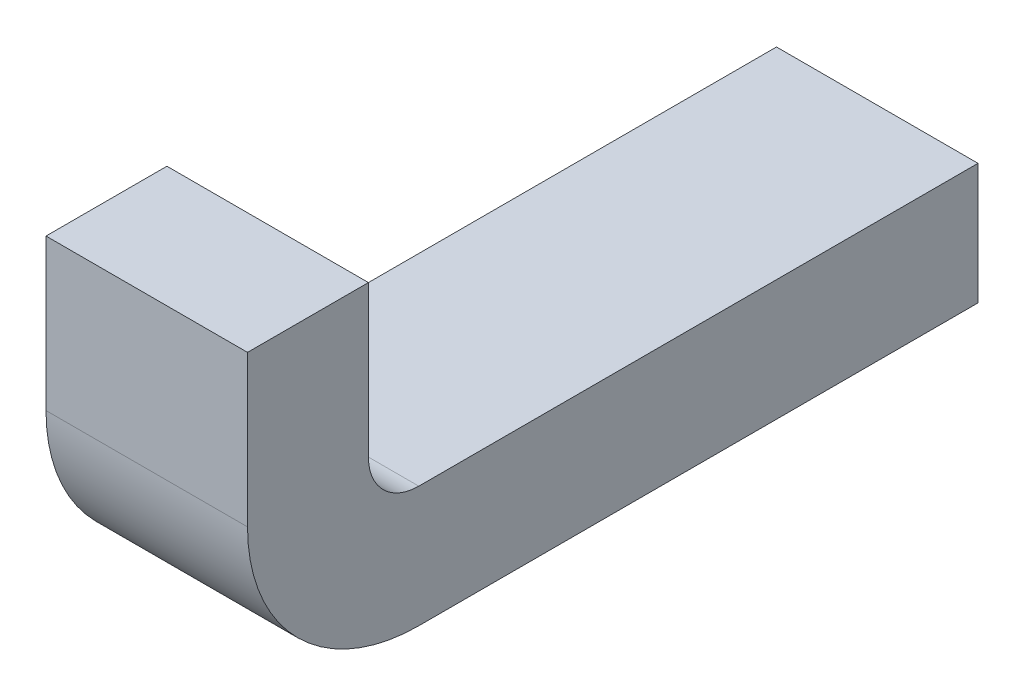
ISO-10303-21;
HEADER;
FILE_DESCRIPTION(('STEP AP214'),'2;1');
FILE_NAME('part.step','',(''),(''),'','','');
FILE_SCHEMA(('AUTOMOTIVE_DESIGN { 1 0 10303 214 1 1 1 1 }'));
ENDSEC;
DATA;
#1=APPLICATION_CONTEXT('core data for automotive mechanical design processes');
#2=APPLICATION_PROTOCOL_DEFINITION('international standard','automotive_design',2000,#1);
#3=PRODUCT_CONTEXT('',#1,'mechanical');
#4=PRODUCT('Part','Part','',(#3));
#5=PRODUCT_RELATED_PRODUCT_CATEGORY('part','',(#4));
#6=PRODUCT_DEFINITION_FORMATION('','',#4);
#7=PRODUCT_DEFINITION_CONTEXT('part definition',#1,'design');
#8=PRODUCT_DEFINITION('design','',#6,#7);
#9=PRODUCT_DEFINITION_SHAPE('','',#8);
#10=(LENGTH_UNIT() NAMED_UNIT(*) SI_UNIT(.MILLI.,.METRE.));
#11=(NAMED_UNIT(*) PLANE_ANGLE_UNIT() SI_UNIT($,.RADIAN.));
#12=(NAMED_UNIT(*) SI_UNIT($,.STERADIAN.) SOLID_ANGLE_UNIT());
#13=UNCERTAINTY_MEASURE_WITH_UNIT(LENGTH_MEASURE(1.E-05),#10,'distance_accuracy_value','');
#14=(GEOMETRIC_REPRESENTATION_CONTEXT(3) GLOBAL_UNCERTAINTY_ASSIGNED_CONTEXT((#13)) GLOBAL_UNIT_ASSIGNED_CONTEXT((#10,
#11,#12)) REPRESENTATION_CONTEXT('',''));
#15=CARTESIAN_POINT('',(0.,0.,0.));
#16=DIRECTION('',(0.,0.,1.));
#17=DIRECTION('',(1.,0.,0.));
#18=AXIS2_PLACEMENT_3D('',#15,#16,#17);
#19=CARTESIAN_POINT('',(1.65,0.,-3.300000000002));
#20=DIRECTION('',(0.,-1.,0.));
#21=DIRECTION('',(1.,0.,0.));
#22=AXIS2_PLACEMENT_3D('',#19,#20,#21);
#23=PLANE('',#22);
#24=DIRECTION('',(0.,0.,1.));
#25=VECTOR('',#24,1.);
#26=CARTESIAN_POINT('',(1.65,0.,-3.300000000002));
#27=LINE('',#26,#25);
#28=CARTESIAN_POINT('',(1.65,0.,-3.300000000002));
#29=VERTEX_POINT('',#28);
#30=CARTESIAN_POINT('',(1.65,0.,-3.854999999999));
#31=VERTEX_POINT('',#30);
#32=EDGE_CURVE('E121',#29,#31,#27,.F.);
#33=ORIENTED_EDGE('',*,*,#32,.T.);
#34=DIRECTION('',(-1.,0.,0.));
#35=VECTOR('',#34,1.);
#36=CARTESIAN_POINT('',(1.65,0.,-3.854999999999));
#37=LINE('',#36,#35);
#38=CARTESIAN_POINT('',(1.85,0.,-3.854999999999));
#39=VERTEX_POINT('',#38);
#40=EDGE_CURVE('E124',#39,#31,#37,.T.);
#41=ORIENTED_EDGE('',*,*,#40,.F.);
#42=DIRECTION('',(0.,0.,1.));
#43=VECTOR('',#42,1.);
#44=CARTESIAN_POINT('',(1.85,0.,-3.300000000002));
#45=LINE('',#44,#43);
#46=CARTESIAN_POINT('',(1.85,0.,-3.300000000002));
#47=VERTEX_POINT('',#46);
#48=EDGE_CURVE('E154',#47,#39,#45,.F.);
#49=ORIENTED_EDGE('',*,*,#48,.F.);
#50=DIRECTION('',(1.,0.,0.));
#51=VECTOR('',#50,1.);
#52=CARTESIAN_POINT('',(1.65,0.,-3.300000000002));
#53=LINE('',#52,#51);
#54=EDGE_CURVE('E63',#29,#47,#53,.T.);
#55=ORIENTED_EDGE('',*,*,#54,.F.);
#56=EDGE_LOOP('',(#33,#41,#49,#55));
#57=FACE_BOUND('',#56,.T.);
#58=ADVANCED_FACE('F16',(#57),#23,.T.);
#59=CARTESIAN_POINT('',(1.65,0.32,-3.250000000002));
#60=DIRECTION('',(0.,1.,1.246832498358E-13));
#61=DIRECTION('',(0.,-1.246832498358E-13,1.));
#62=AXIS2_PLACEMENT_3D('',#59,#60,#61);
#63=PLANE('',#62);
#64=DIRECTION('',(0.,0.,1.));
#65=VECTOR('',#64,1.);
#66=CARTESIAN_POINT('',(1.65,0.32,-3.300000000002));
#67=LINE('',#66,#65);
#68=CARTESIAN_POINT('',(1.65,0.32,-3.250000000002));
#69=VERTEX_POINT('',#68);
#70=CARTESIAN_POINT('',(1.65,0.32,-3.130000000002));
#71=VERTEX_POINT('',#70);
#72=EDGE_CURVE('E100',#69,#71,#67,.T.);
#73=ORIENTED_EDGE('',*,*,#72,.T.);
#74=DIRECTION('',(1.,0.,0.));
#75=VECTOR('',#74,1.);
#76=CARTESIAN_POINT('',(1.65,0.32,-3.130000000002));
#77=LINE('',#76,#75);
#78=CARTESIAN_POINT('',(1.85,0.32,-3.130000000002));
#79=VERTEX_POINT('',#78);
#80=EDGE_CURVE('E162',#79,#71,#77,.F.);
#81=ORIENTED_EDGE('',*,*,#80,.F.);
#82=DIRECTION('',(0.,0.,1.));
#83=VECTOR('',#82,1.);
#84=CARTESIAN_POINT('',(1.85,0.32,-3.300000000002));
#85=LINE('',#84,#83);
#86=CARTESIAN_POINT('',(1.85,0.32,-3.250000000002));
#87=VERTEX_POINT('',#86);
#88=EDGE_CURVE('E150',#87,#79,#85,.T.);
#89=ORIENTED_EDGE('',*,*,#88,.F.);
#90=DIRECTION('',(-1.,0.,0.));
#91=VECTOR('',#90,1.);
#92=CARTESIAN_POINT('',(1.65,0.32,-3.250000000002));
#93=LINE('',#92,#91);
#94=EDGE_CURVE('E72',#69,#87,#93,.F.);
#95=ORIENTED_EDGE('',*,*,#94,.F.);
#96=EDGE_LOOP('',(#73,#81,#89,#95));
#97=FACE_BOUND('',#96,.T.);
#98=ADVANCED_FACE('F182',(#97),#63,.T.);
#99=CARTESIAN_POINT('',(1.65,0.32,-3.130000000002));
#100=DIRECTION('',(0.,0.,1.));
#101=DIRECTION('',(1.,0.,0.));
#102=AXIS2_PLACEMENT_3D('',#99,#100,#101);
#103=PLANE('',#102);
#104=DIRECTION('',(0.,1.,0.));
#105=VECTOR('',#104,1.);
#106=CARTESIAN_POINT('',(1.65,0.17,-3.130000000002));
#107=LINE('',#106,#105);
#108=CARTESIAN_POINT('',(1.65,0.17,-3.130000000002));
#109=VERTEX_POINT('',#108);
#110=EDGE_CURVE('E110',#71,#109,#107,.F.);
#111=ORIENTED_EDGE('',*,*,#110,.T.);
#112=DIRECTION('',(1.,0.,0.));
#113=VECTOR('',#112,1.);
#114=CARTESIAN_POINT('',(1.65,0.17,-3.130000000002));
#115=LINE('',#114,#113);
#116=CARTESIAN_POINT('',(1.85,0.17,-3.130000000002));
#117=VERTEX_POINT('',#116);
#118=EDGE_CURVE('E57',#117,#109,#115,.F.);
#119=ORIENTED_EDGE('',*,*,#118,.F.);
#120=DIRECTION('',(0.,1.,0.));
#121=VECTOR('',#120,1.);
#122=CARTESIAN_POINT('',(1.85,0.17,-3.130000000002));
#123=LINE('',#122,#121);
#124=EDGE_CURVE('E141',#79,#117,#123,.F.);
#125=ORIENTED_EDGE('',*,*,#124,.F.);
#126=ORIENTED_EDGE('',*,*,#80,.T.);
#127=EDGE_LOOP('',(#111,#119,#125,#126));
#128=FACE_BOUND('',#127,.T.);
#129=ADVANCED_FACE('F183',(#128),#103,.T.);
#130=CARTESIAN_POINT('',(1.65,0.17,-3.300000000002));
#131=DIRECTION('',(1.,0.,0.));
#132=DIRECTION('',(0.,1.,0.));
#133=AXIS2_PLACEMENT_3D('',#130,#131,#132);
#134=CYLINDRICAL_SURFACE('',#133,0.17);
#135=CARTESIAN_POINT('',(1.65,0.17,-3.300000000002));
#136=DIRECTION('',(1.,0.,0.));
#137=DIRECTION('',(0.,1.,0.));
#138=AXIS2_PLACEMENT_3D('',#135,#136,#137);
#139=CIRCLE('',#138,0.17);
#140=EDGE_CURVE('E96',#109,#29,#139,.T.);
#141=ORIENTED_EDGE('',*,*,#140,.T.);
#142=ORIENTED_EDGE('',*,*,#54,.T.);
#143=CARTESIAN_POINT('',(1.85,0.17,-3.300000000002));
#144=DIRECTION('',(1.,0.,0.));
#145=DIRECTION('',(0.,1.,0.));
#146=AXIS2_PLACEMENT_3D('',#143,#144,#145);
#147=CIRCLE('',#146,0.17);
#148=EDGE_CURVE('E19',#117,#47,#147,.T.);
#149=ORIENTED_EDGE('',*,*,#148,.F.);
#150=ORIENTED_EDGE('',*,*,#118,.T.);
#151=EDGE_LOOP('',(#141,#142,#149,#150));
#152=FACE_BOUND('',#151,.T.);
#153=ADVANCED_FACE('F185',(#152),#134,.T.);
#154=CARTESIAN_POINT('',(1.65,0.17,-3.250000000002));
#155=DIRECTION('',(0.,0.,-1.));
#156=DIRECTION('',(-1.,0.,0.));
#157=AXIS2_PLACEMENT_3D('',#154,#155,#156);
#158=PLANE('',#157);
#159=DIRECTION('',(0.,1.,0.));
#160=VECTOR('',#159,1.);
#161=CARTESIAN_POINT('',(1.65,0.17,-3.250000000002));
#162=LINE('',#161,#160);
#163=CARTESIAN_POINT('',(1.65,0.17,-3.250000000002));
#164=VERTEX_POINT('',#163);
#165=EDGE_CURVE('E92',#164,#69,#162,.T.);
#166=ORIENTED_EDGE('',*,*,#165,.T.);
#167=ORIENTED_EDGE('',*,*,#94,.T.);
#168=DIRECTION('',(0.,1.,0.));
#169=VECTOR('',#168,1.);
#170=CARTESIAN_POINT('',(1.85,0.17,-3.250000000002));
#171=LINE('',#170,#169);
#172=CARTESIAN_POINT('',(1.85,0.17,-3.250000000002));
#173=VERTEX_POINT('',#172);
#174=EDGE_CURVE('E87',#173,#87,#171,.T.);
#175=ORIENTED_EDGE('',*,*,#174,.F.);
#176=DIRECTION('',(1.,0.,0.));
#177=VECTOR('',#176,1.);
#178=CARTESIAN_POINT('',(1.65,0.17,-3.250000000002));
#179=LINE('',#178,#177);
#180=EDGE_CURVE('E90',#173,#164,#179,.F.);
#181=ORIENTED_EDGE('',*,*,#180,.T.);
#182=EDGE_LOOP('',(#166,#167,#175,#181));
#183=FACE_BOUND('',#182,.T.);
#184=ADVANCED_FACE('F91',(#183),#158,.T.);
#185=CARTESIAN_POINT('',(1.85,0.17,-3.300000000002));
#186=DIRECTION('',(1.,0.,0.));
#187=DIRECTION('',(0.,1.,0.));
#188=AXIS2_PLACEMENT_3D('',#185,#186,#187);
#189=PLANE('',#188);
#190=ORIENTED_EDGE('',*,*,#88,.T.);
#191=ORIENTED_EDGE('',*,*,#124,.T.);
#192=ORIENTED_EDGE('',*,*,#148,.T.);
#193=ORIENTED_EDGE('',*,*,#48,.T.);
#194=DIRECTION('',(0.,1.,0.));
#195=VECTOR('',#194,1.);
#196=CARTESIAN_POINT('',(1.85,0.,-3.854999999999));
#197=LINE('',#196,#195);
#198=CARTESIAN_POINT('',(1.85,0.12,-3.854999999999));
#199=VERTEX_POINT('',#198);
#200=EDGE_CURVE('E138',#199,#39,#197,.F.);
#201=ORIENTED_EDGE('',*,*,#200,.F.);
#202=DIRECTION('',(0.,0.,1.));
#203=VECTOR('',#202,1.);
#204=CARTESIAN_POINT('',(1.85,0.12,-3.854999999999));
#205=LINE('',#204,#203);
#206=CARTESIAN_POINT('',(1.85,0.119999999999999,-3.300000000002));
#207=VERTEX_POINT('',#206);
#208=EDGE_CURVE('E107',#207,#199,#205,.F.);
#209=ORIENTED_EDGE('',*,*,#208,.F.);
#210=CARTESIAN_POINT('',(1.85,0.17,-3.300000000002));
#211=DIRECTION('',(1.,0.,0.));
#212=DIRECTION('',(0.,1.,0.));
#213=AXIS2_PLACEMENT_3D('',#210,#211,#212);
#214=CIRCLE('',#213,0.05);
#215=EDGE_CURVE('E105',#207,#173,#214,.F.);
#216=ORIENTED_EDGE('',*,*,#215,.T.);
#217=ORIENTED_EDGE('',*,*,#174,.T.);
#218=EDGE_LOOP('',(#190,#191,#192,#193,#201,#209,#216,#217));
#219=FACE_BOUND('',#218,.T.);
#220=ADVANCED_FACE('F179',(#219),#189,.T.);
#221=CARTESIAN_POINT('',(1.65,0.,-3.854999999999));
#222=DIRECTION('',(0.,0.,-1.));
#223=DIRECTION('',(-1.,0.,0.));
#224=AXIS2_PLACEMENT_3D('',#221,#222,#223);
#225=PLANE('',#224);
#226=DIRECTION('',(0.,1.,0.));
#227=VECTOR('',#226,1.);
#228=CARTESIAN_POINT('',(1.65,0.17,-3.854999999999));
#229=LINE('',#228,#227);
#230=CARTESIAN_POINT('',(1.65,0.12,-3.854999999999));
#231=VERTEX_POINT('',#230);
#232=EDGE_CURVE('E101',#31,#231,#229,.T.);
#233=ORIENTED_EDGE('',*,*,#232,.T.);
#234=DIRECTION('',(-1.,0.,0.));
#235=VECTOR('',#234,1.);
#236=CARTESIAN_POINT('',(1.65,0.12,-3.854999999999));
#237=LINE('',#236,#235);
#238=EDGE_CURVE('E128',#199,#231,#237,.T.);
#239=ORIENTED_EDGE('',*,*,#238,.F.);
#240=ORIENTED_EDGE('',*,*,#200,.T.);
#241=ORIENTED_EDGE('',*,*,#40,.T.);
#242=EDGE_LOOP('',(#233,#239,#240,#241));
#243=FACE_BOUND('',#242,.T.);
#244=ADVANCED_FACE('F204',(#243),#225,.T.);
#245=CARTESIAN_POINT('',(1.65,0.17,-3.300000000002));
#246=DIRECTION('',(1.,0.,0.));
#247=DIRECTION('',(0.,1.,0.));
#248=AXIS2_PLACEMENT_3D('',#245,#246,#247);
#249=PLANE('',#248);
#250=ORIENTED_EDGE('',*,*,#110,.F.);
#251=ORIENTED_EDGE('',*,*,#72,.F.);
#252=ORIENTED_EDGE('',*,*,#165,.F.);
#253=CARTESIAN_POINT('',(1.65,0.17,-3.300000000002));
#254=DIRECTION('',(1.,0.,0.));
#255=DIRECTION('',(0.,1.,0.));
#256=AXIS2_PLACEMENT_3D('',#253,#254,#255);
#257=CIRCLE('',#256,0.05);
#258=CARTESIAN_POINT('',(1.65,0.12,-3.300000000002));
#259=VERTEX_POINT('',#258);
#260=EDGE_CURVE('E34',#164,#259,#257,.T.);
#261=ORIENTED_EDGE('',*,*,#260,.T.);
#262=DIRECTION('',(0.,0.,1.));
#263=VECTOR('',#262,1.);
#264=CARTESIAN_POINT('',(1.65,0.12,-3.854999999999));
#265=LINE('',#264,#263);
#266=EDGE_CURVE('E25',#231,#259,#265,.T.);
#267=ORIENTED_EDGE('',*,*,#266,.F.);
#268=ORIENTED_EDGE('',*,*,#232,.F.);
#269=ORIENTED_EDGE('',*,*,#32,.F.);
#270=ORIENTED_EDGE('',*,*,#140,.F.);
#271=EDGE_LOOP('',(#250,#251,#252,#261,#267,#268,#269,#270));
#272=FACE_BOUND('',#271,.T.);
#273=ADVANCED_FACE('F99',(#272),#249,.F.);
#274=CARTESIAN_POINT('',(1.65,0.17,-3.300000000002));
#275=DIRECTION('',(1.,0.,0.));
#276=DIRECTION('',(0.,1.,0.));
#277=AXIS2_PLACEMENT_3D('',#274,#275,#276);
#278=CYLINDRICAL_SURFACE('',#277,0.05);
#279=DIRECTION('',(-1.,0.,0.));
#280=VECTOR('',#279,1.);
#281=CARTESIAN_POINT('',(1.65,0.12,-3.300000000002));
#282=LINE('',#281,#280);
#283=EDGE_CURVE('E11',#259,#207,#282,.F.);
#284=ORIENTED_EDGE('',*,*,#283,.F.);
#285=ORIENTED_EDGE('',*,*,#260,.F.);
#286=ORIENTED_EDGE('',*,*,#180,.F.);
#287=ORIENTED_EDGE('',*,*,#215,.F.);
#288=EDGE_LOOP('',(#284,#285,#286,#287));
#289=FACE_BOUND('',#288,.T.);
#290=ADVANCED_FACE('F103',(#289),#278,.F.);
#291=CARTESIAN_POINT('',(1.65,0.12,-3.854999999999));
#292=DIRECTION('',(0.,1.,0.));
#293=DIRECTION('',(-1.,0.,0.));
#294=AXIS2_PLACEMENT_3D('',#291,#292,#293);
#295=PLANE('',#294);
#296=ORIENTED_EDGE('',*,*,#266,.T.);
#297=ORIENTED_EDGE('',*,*,#283,.T.);
#298=ORIENTED_EDGE('',*,*,#208,.T.);
#299=ORIENTED_EDGE('',*,*,#238,.T.);
#300=EDGE_LOOP('',(#296,#297,#298,#299));
#301=FACE_BOUND('',#300,.T.);
#302=ADVANCED_FACE('F193',(#301),#295,.T.);
#303=CLOSED_SHELL('',(#58,#98,#129,#153,#184,#220,#244,#273,#290,#302));
#304=MANIFOLD_SOLID_BREP('B1',#303);
#305=ADVANCED_BREP_SHAPE_REPRESENTATION('',(#18,#304),#14);
#306=SHAPE_DEFINITION_REPRESENTATION(#9,#305);
ENDSEC;
END-ISO-10303-21;
